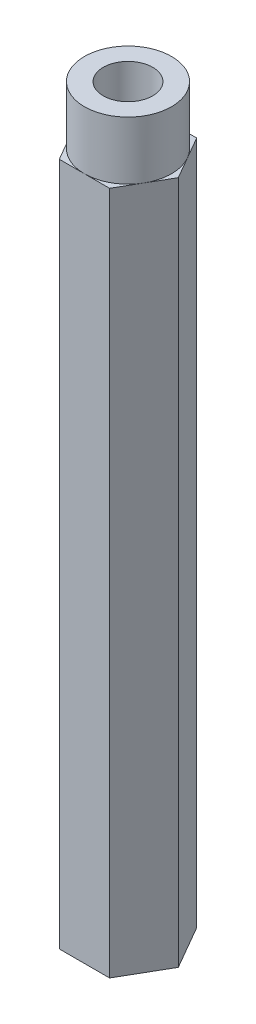
ISO-10303-21;
HEADER;
FILE_DESCRIPTION(('STEP AP214'),'2;1');
FILE_NAME('part.step','',(''),(''),'','','');
FILE_SCHEMA(('AUTOMOTIVE_DESIGN { 1 0 10303 214 1 1 1 1 }'));
ENDSEC;
DATA;
#1=APPLICATION_CONTEXT('core data for automotive mechanical design processes');
#2=APPLICATION_PROTOCOL_DEFINITION('international standard','automotive_design',2000,#1);
#3=PRODUCT_CONTEXT('',#1,'mechanical');
#4=PRODUCT('Part','Part','',(#3));
#5=PRODUCT_RELATED_PRODUCT_CATEGORY('part','',(#4));
#6=PRODUCT_DEFINITION_FORMATION('','',#4);
#7=PRODUCT_DEFINITION_CONTEXT('part definition',#1,'design');
#8=PRODUCT_DEFINITION('design','',#6,#7);
#9=PRODUCT_DEFINITION_SHAPE('','',#8);
#10=(LENGTH_UNIT() NAMED_UNIT(*) SI_UNIT(.MILLI.,.METRE.));
#11=(NAMED_UNIT(*) PLANE_ANGLE_UNIT() SI_UNIT($,.RADIAN.));
#12=(NAMED_UNIT(*) SI_UNIT($,.STERADIAN.) SOLID_ANGLE_UNIT());
#13=UNCERTAINTY_MEASURE_WITH_UNIT(LENGTH_MEASURE(1.E-05),#10,'distance_accuracy_value','');
#14=(GEOMETRIC_REPRESENTATION_CONTEXT(3) GLOBAL_UNCERTAINTY_ASSIGNED_CONTEXT((#13)) GLOBAL_UNIT_ASSIGNED_CONTEXT((#10,
#11,#12)) REPRESENTATION_CONTEXT('',''));
#15=CARTESIAN_POINT('',(0.,0.,0.));
#16=DIRECTION('',(0.,0.,1.));
#17=DIRECTION('',(1.,0.,0.));
#18=AXIS2_PLACEMENT_3D('',#15,#16,#17);
#19=CARTESIAN_POINT('',(0.,18.6944,0.));
#20=DIRECTION('',(0.,1.,0.));
#21=DIRECTION('',(0.,0.,1.));
#22=AXIS2_PLACEMENT_3D('',#19,#20,#21);
#23=PLANE('',#22);
#24=CARTESIAN_POINT('',(0.,18.6944,0.));
#25=DIRECTION('',(0.,1.,0.));
#26=DIRECTION('',(0.,0.,1.));
#27=AXIS2_PLACEMENT_3D('',#24,#25,#26);
#28=CIRCLE('',#27,2.38125);
#29=CARTESIAN_POINT('',(0.,18.6944,2.38125));
#30=VERTEX_POINT('',#29);
#31=CARTESIAN_POINT('',(2.06222299276169,18.6944,1.190625));
#32=VERTEX_POINT('',#31);
#33=EDGE_CURVE('E51',#30,#32,#28,.T.);
#34=ORIENTED_EDGE('',*,*,#33,.F.);
#35=DIRECTION('',(1.,0.,0.));
#36=VECTOR('',#35,1.);
#37=CARTESIAN_POINT('',(-1.3748153285078,18.6944,2.38125));
#38=LINE('',#37,#36);
#39=CARTESIAN_POINT('',(1.3748153285078,18.6944,2.38125));
#40=VERTEX_POINT('',#39);
#41=EDGE_CURVE('E122',#30,#40,#38,.T.);
#42=ORIENTED_EDGE('',*,*,#41,.T.);
#43=DIRECTION('',(0.5,0.,-0.866025403784439));
#44=VECTOR('',#43,1.);
#45=CARTESIAN_POINT('',(1.3748153285078,18.6944,2.38125));
#46=LINE('',#45,#44);
#47=EDGE_CURVE('E134',#40,#32,#46,.T.);
#48=ORIENTED_EDGE('',*,*,#47,.T.);
#49=EDGE_LOOP('',(#34,#42,#48));
#50=FACE_BOUND('',#49,.T.);
#51=ADVANCED_FACE('F39',(#50),#23,.T.);
#52=CARTESIAN_POINT('',(2.06222299276169,18.6944,-1.190625));
#53=VERTEX_POINT('',#52);
#54=EDGE_CURVE('E11',#32,#53,#28,.T.);
#55=ORIENTED_EDGE('',*,*,#54,.F.);
#56=CARTESIAN_POINT('',(2.74963065701559,18.6944,0.));
#57=VERTEX_POINT('',#56);
#58=EDGE_CURVE('E121',#32,#57,#46,.T.);
#59=ORIENTED_EDGE('',*,*,#58,.T.);
#60=DIRECTION('',(-0.5,0.,-0.866025403784439));
#61=VECTOR('',#60,1.);
#62=CARTESIAN_POINT('',(2.74963065701559,18.6944,0.));
#63=LINE('',#62,#61);
#64=EDGE_CURVE('E152',#57,#53,#63,.T.);
#65=ORIENTED_EDGE('',*,*,#64,.T.);
#66=EDGE_LOOP('',(#55,#59,#65));
#67=FACE_BOUND('',#66,.T.);
#68=ADVANCED_FACE('F235',(#67),#23,.T.);
#69=CARTESIAN_POINT('',(0.,18.6944,-2.38125));
#70=VERTEX_POINT('',#69);
#71=EDGE_CURVE('E49',#53,#70,#28,.T.);
#72=ORIENTED_EDGE('',*,*,#71,.F.);
#73=CARTESIAN_POINT('',(1.37481532850779,18.6944,-2.38125));
#74=VERTEX_POINT('',#73);
#75=EDGE_CURVE('E151',#53,#74,#63,.T.);
#76=ORIENTED_EDGE('',*,*,#75,.T.);
#77=DIRECTION('',(-1.,0.,0.));
#78=VECTOR('',#77,1.);
#79=CARTESIAN_POINT('',(1.37481532850779,18.6944,-2.38125));
#80=LINE('',#79,#78);
#81=EDGE_CURVE('E157',#74,#70,#80,.T.);
#82=ORIENTED_EDGE('',*,*,#81,.T.);
#83=EDGE_LOOP('',(#72,#76,#82));
#84=FACE_BOUND('',#83,.T.);
#85=ADVANCED_FACE('F232',(#84),#23,.T.);
#86=CARTESIAN_POINT('',(-2.06222299276169,18.6944,-1.190625));
#87=VERTEX_POINT('',#86);
#88=EDGE_CURVE('E144',#70,#87,#28,.T.);
#89=ORIENTED_EDGE('',*,*,#88,.F.);
#90=CARTESIAN_POINT('',(-1.3748153285078,18.6944,-2.38125));
#91=VERTEX_POINT('',#90);
#92=EDGE_CURVE('E156',#70,#91,#80,.T.);
#93=ORIENTED_EDGE('',*,*,#92,.T.);
#94=DIRECTION('',(-0.5,0.,0.866025403784439));
#95=VECTOR('',#94,1.);
#96=CARTESIAN_POINT('',(-1.3748153285078,18.6944,-2.38125));
#97=LINE('',#96,#95);
#98=EDGE_CURVE('E162',#91,#87,#97,.T.);
#99=ORIENTED_EDGE('',*,*,#98,.T.);
#100=EDGE_LOOP('',(#89,#93,#99));
#101=FACE_BOUND('',#100,.T.);
#102=ADVANCED_FACE('F227',(#101),#23,.T.);
#103=CARTESIAN_POINT('',(-2.06222299276169,18.6944,1.190625));
#104=VERTEX_POINT('',#103);
#105=EDGE_CURVE('E66',#87,#104,#28,.T.);
#106=ORIENTED_EDGE('',*,*,#105,.F.);
#107=CARTESIAN_POINT('',(-2.74963065701559,18.6944,0.));
#108=VERTEX_POINT('',#107);
#109=EDGE_CURVE('E161',#87,#108,#97,.T.);
#110=ORIENTED_EDGE('',*,*,#109,.T.);
#111=DIRECTION('',(0.5,0.,0.866025403784439));
#112=VECTOR('',#111,1.);
#113=CARTESIAN_POINT('',(-2.74963065701559,18.6944,0.));
#114=LINE('',#113,#112);
#115=EDGE_CURVE('E166',#108,#104,#114,.T.);
#116=ORIENTED_EDGE('',*,*,#115,.T.);
#117=EDGE_LOOP('',(#106,#110,#116));
#118=FACE_BOUND('',#117,.T.);
#119=ADVANCED_FACE('F268',(#118),#23,.T.);
#120=CARTESIAN_POINT('',(-1.3748153285078,18.6944,2.38125));
#121=DIRECTION('',(0.,0.,-1.));
#122=DIRECTION('',(-1.,0.,0.));
#123=AXIS2_PLACEMENT_3D('',#120,#121,#122);
#124=PLANE('',#123);
#125=DIRECTION('',(1.,0.,0.));
#126=VECTOR('',#125,1.);
#127=CARTESIAN_POINT('',(-1.3748153285078,-18.6944,2.38125));
#128=LINE('',#127,#126);
#129=CARTESIAN_POINT('',(-1.3748153285078,-18.6944,2.38125));
#130=VERTEX_POINT('',#129);
#131=CARTESIAN_POINT('',(1.3748153285078,-18.6944,2.38125));
#132=VERTEX_POINT('',#131);
#133=EDGE_CURVE('E170',#130,#132,#128,.T.);
#134=ORIENTED_EDGE('',*,*,#133,.T.);
#135=DIRECTION('',(0.,-1.,0.));
#136=VECTOR('',#135,1.);
#137=CARTESIAN_POINT('',(1.3748153285078,18.6944,2.38125));
#138=LINE('',#137,#136);
#139=EDGE_CURVE('E43',#40,#132,#138,.T.);
#140=ORIENTED_EDGE('',*,*,#139,.F.);
#141=ORIENTED_EDGE('',*,*,#41,.F.);
#142=CARTESIAN_POINT('',(-1.3748153285078,18.6944,2.38125));
#143=VERTEX_POINT('',#142);
#144=EDGE_CURVE('E113',#143,#30,#38,.T.);
#145=ORIENTED_EDGE('',*,*,#144,.F.);
#146=DIRECTION('',(0.,-1.,0.));
#147=VECTOR('',#146,1.);
#148=CARTESIAN_POINT('',(-1.3748153285078,18.6944,2.38125));
#149=LINE('',#148,#147);
#150=EDGE_CURVE('E169',#143,#130,#149,.T.);
#151=ORIENTED_EDGE('',*,*,#150,.T.);
#152=EDGE_LOOP('',(#134,#140,#141,#145,#151));
#153=FACE_BOUND('',#152,.T.);
#154=ADVANCED_FACE('F41',(#153),#124,.F.);
#155=CARTESIAN_POINT('',(1.3748153285078,18.6944,2.38125));
#156=DIRECTION('',(-0.866025403784439,0.,-0.5));
#157=DIRECTION('',(-0.5,0.,0.866025403784439));
#158=AXIS2_PLACEMENT_3D('',#155,#156,#157);
#159=PLANE('',#158);
#160=DIRECTION('',(0.5,0.,-0.866025403784439));
#161=VECTOR('',#160,1.);
#162=CARTESIAN_POINT('',(1.3748153285078,-18.6944,2.38125));
#163=LINE('',#162,#161);
#164=CARTESIAN_POINT('',(2.74963065701559,-18.6944,0.));
#165=VERTEX_POINT('',#164);
#166=EDGE_CURVE('E173',#132,#165,#163,.T.);
#167=ORIENTED_EDGE('',*,*,#166,.T.);
#168=DIRECTION('',(0.,-1.,0.));
#169=VECTOR('',#168,1.);
#170=CARTESIAN_POINT('',(2.74963065701559,18.6944,0.));
#171=LINE('',#170,#169);
#172=EDGE_CURVE('E145',#57,#165,#171,.T.);
#173=ORIENTED_EDGE('',*,*,#172,.F.);
#174=ORIENTED_EDGE('',*,*,#58,.F.);
#175=ORIENTED_EDGE('',*,*,#47,.F.);
#176=ORIENTED_EDGE('',*,*,#139,.T.);
#177=EDGE_LOOP('',(#167,#173,#174,#175,#176));
#178=FACE_BOUND('',#177,.T.);
#179=ADVANCED_FACE('F279',(#178),#159,.F.);
#180=CARTESIAN_POINT('',(2.74963065701559,18.6944,0.));
#181=DIRECTION('',(-0.866025403784439,0.,0.5));
#182=DIRECTION('',(0.5,0.,0.866025403784439));
#183=AXIS2_PLACEMENT_3D('',#180,#181,#182);
#184=PLANE('',#183);
#185=DIRECTION('',(-0.5,0.,-0.866025403784439));
#186=VECTOR('',#185,1.);
#187=CARTESIAN_POINT('',(2.74963065701559,-18.6944,0.));
#188=LINE('',#187,#186);
#189=CARTESIAN_POINT('',(1.37481532850779,-18.6944,-2.38125));
#190=VERTEX_POINT('',#189);
#191=EDGE_CURVE('E176',#165,#190,#188,.T.);
#192=ORIENTED_EDGE('',*,*,#191,.T.);
#193=DIRECTION('',(0.,-1.,0.));
#194=VECTOR('',#193,1.);
#195=CARTESIAN_POINT('',(1.37481532850779,18.6944,-2.38125));
#196=LINE('',#195,#194);
#197=EDGE_CURVE('E197',#74,#190,#196,.T.);
#198=ORIENTED_EDGE('',*,*,#197,.F.);
#199=ORIENTED_EDGE('',*,*,#75,.F.);
#200=ORIENTED_EDGE('',*,*,#64,.F.);
#201=ORIENTED_EDGE('',*,*,#172,.T.);
#202=EDGE_LOOP('',(#192,#198,#199,#200,#201));
#203=FACE_BOUND('',#202,.T.);
#204=ADVANCED_FACE('F206',(#203),#184,.F.);
#205=CARTESIAN_POINT('',(1.37481532850779,18.6944,-2.38125));
#206=DIRECTION('',(0.,0.,1.));
#207=DIRECTION('',(1.,0.,0.));
#208=AXIS2_PLACEMENT_3D('',#205,#206,#207);
#209=PLANE('',#208);
#210=DIRECTION('',(-1.,0.,0.));
#211=VECTOR('',#210,1.);
#212=CARTESIAN_POINT('',(1.37481532850779,-18.6944,-2.38125));
#213=LINE('',#212,#211);
#214=CARTESIAN_POINT('',(-1.3748153285078,-18.6944,-2.38125));
#215=VERTEX_POINT('',#214);
#216=EDGE_CURVE('E179',#190,#215,#213,.T.);
#217=ORIENTED_EDGE('',*,*,#216,.T.);
#218=DIRECTION('',(0.,-1.,0.));
#219=VECTOR('',#218,1.);
#220=CARTESIAN_POINT('',(-1.3748153285078,18.6944,-2.38125));
#221=LINE('',#220,#219);
#222=EDGE_CURVE('E193',#91,#215,#221,.T.);
#223=ORIENTED_EDGE('',*,*,#222,.F.);
#224=ORIENTED_EDGE('',*,*,#92,.F.);
#225=ORIENTED_EDGE('',*,*,#81,.F.);
#226=ORIENTED_EDGE('',*,*,#197,.T.);
#227=EDGE_LOOP('',(#217,#223,#224,#225,#226));
#228=FACE_BOUND('',#227,.T.);
#229=ADVANCED_FACE('F219',(#228),#209,.F.);
#230=CARTESIAN_POINT('',(-1.3748153285078,18.6944,-2.38125));
#231=DIRECTION('',(0.866025403784439,0.,0.5));
#232=DIRECTION('',(0.5,0.,-0.866025403784439));
#233=AXIS2_PLACEMENT_3D('',#230,#231,#232);
#234=PLANE('',#233);
#235=DIRECTION('',(-0.5,0.,0.866025403784439));
#236=VECTOR('',#235,1.);
#237=CARTESIAN_POINT('',(-1.3748153285078,-18.6944,-2.38125));
#238=LINE('',#237,#236);
#239=CARTESIAN_POINT('',(-2.74963065701559,-18.6944,0.));
#240=VERTEX_POINT('',#239);
#241=EDGE_CURVE('E182',#215,#240,#238,.T.);
#242=ORIENTED_EDGE('',*,*,#241,.T.);
#243=DIRECTION('',(0.,-1.,0.));
#244=VECTOR('',#243,1.);
#245=CARTESIAN_POINT('',(-2.74963065701559,18.6944,0.));
#246=LINE('',#245,#244);
#247=EDGE_CURVE('E189',#108,#240,#246,.T.);
#248=ORIENTED_EDGE('',*,*,#247,.F.);
#249=ORIENTED_EDGE('',*,*,#109,.F.);
#250=ORIENTED_EDGE('',*,*,#98,.F.);
#251=ORIENTED_EDGE('',*,*,#222,.T.);
#252=EDGE_LOOP('',(#242,#248,#249,#250,#251));
#253=FACE_BOUND('',#252,.T.);
#254=ADVANCED_FACE('F224',(#253),#234,.F.);
#255=CARTESIAN_POINT('',(-2.74963065701559,18.6944,0.));
#256=DIRECTION('',(0.866025403784439,0.,-0.5));
#257=DIRECTION('',(-0.5,0.,-0.866025403784439));
#258=AXIS2_PLACEMENT_3D('',#255,#256,#257);
#259=PLANE('',#258);
#260=DIRECTION('',(0.5,0.,0.866025403784439));
#261=VECTOR('',#260,1.);
#262=CARTESIAN_POINT('',(-2.74963065701559,-18.6944,0.));
#263=LINE('',#262,#261);
#264=EDGE_CURVE('E132',#240,#130,#263,.T.);
#265=ORIENTED_EDGE('',*,*,#264,.T.);
#266=ORIENTED_EDGE('',*,*,#150,.F.);
#267=EDGE_CURVE('E116',#104,#143,#114,.T.);
#268=ORIENTED_EDGE('',*,*,#267,.F.);
#269=ORIENTED_EDGE('',*,*,#115,.F.);
#270=ORIENTED_EDGE('',*,*,#247,.T.);
#271=EDGE_LOOP('',(#265,#266,#268,#269,#270));
#272=FACE_BOUND('',#271,.T.);
#273=ADVANCED_FACE('F267',(#272),#259,.F.);
#274=EDGE_CURVE('E58',#104,#30,#28,.T.);
#275=ORIENTED_EDGE('',*,*,#274,.F.);
#276=ORIENTED_EDGE('',*,*,#267,.T.);
#277=ORIENTED_EDGE('',*,*,#144,.T.);
#278=EDGE_LOOP('',(#275,#276,#277));
#279=FACE_BOUND('',#278,.T.);
#280=ADVANCED_FACE('F115',(#279),#23,.T.);
#281=CARTESIAN_POINT('',(0.,-18.6944,0.));
#282=DIRECTION('',(0.,1.,0.));
#283=DIRECTION('',(0.,0.,1.));
#284=AXIS2_PLACEMENT_3D('',#281,#282,#283);
#285=PLANE('',#284);
#286=ORIENTED_EDGE('',*,*,#133,.F.);
#287=ORIENTED_EDGE('',*,*,#264,.F.);
#288=ORIENTED_EDGE('',*,*,#241,.F.);
#289=ORIENTED_EDGE('',*,*,#216,.F.);
#290=ORIENTED_EDGE('',*,*,#191,.F.);
#291=ORIENTED_EDGE('',*,*,#166,.F.);
#292=EDGE_LOOP('',(#286,#287,#288,#289,#290,#291));
#293=FACE_BOUND('',#292,.T.);
#294=ADVANCED_FACE('F214',(#293),#285,.F.);
#295=CARTESIAN_POINT('',(0.,21.8694,0.));
#296=DIRECTION('',(0.,-1.,0.));
#297=DIRECTION('',(0.,0.,-1.));
#298=AXIS2_PLACEMENT_3D('',#295,#296,#297);
#299=CYLINDRICAL_SURFACE('',#298,2.38125);
#300=CARTESIAN_POINT('',(0.,21.8694,0.));
#301=DIRECTION('',(0.,1.,0.));
#302=DIRECTION('',(0.,0.,1.));
#303=AXIS2_PLACEMENT_3D('',#300,#301,#302);
#304=CIRCLE('',#303,2.38125);
#305=CARTESIAN_POINT('',(0.,21.8694,2.38125));
#306=VERTEX_POINT('',#305);
#307=EDGE_CURVE('E137',#306,#306,#304,.T.);
#308=ORIENTED_EDGE('',*,*,#307,.F.);
#309=EDGE_LOOP('',(#308));
#310=FACE_BOUND('',#309,.T.);
#311=ORIENTED_EDGE('',*,*,#33,.T.);
#312=ORIENTED_EDGE('',*,*,#54,.T.);
#313=ORIENTED_EDGE('',*,*,#71,.T.);
#314=ORIENTED_EDGE('',*,*,#88,.T.);
#315=ORIENTED_EDGE('',*,*,#105,.T.);
#316=ORIENTED_EDGE('',*,*,#274,.T.);
#317=EDGE_LOOP('',(#311,#312,#313,#314,#315,#316));
#318=FACE_BOUND('',#317,.T.);
#319=ADVANCED_FACE('F139',(#310,#318),#299,.T.);
#320=CARTESIAN_POINT('',(0.,21.8694,0.));
#321=DIRECTION('',(0.,1.,0.));
#322=DIRECTION('',(0.,0.,1.));
#323=AXIS2_PLACEMENT_3D('',#320,#321,#322);
#324=PLANE('',#323);
#325=CARTESIAN_POINT('',(0.,21.8694,0.));
#326=DIRECTION('',(0.,1.,0.));
#327=DIRECTION('',(0.,0.,1.));
#328=AXIS2_PLACEMENT_3D('',#325,#326,#327);
#329=CIRCLE('',#328,1.35255);
#330=CARTESIAN_POINT('',(0.,21.8694,1.35255));
#331=VERTEX_POINT('',#330);
#332=EDGE_CURVE('E242',#331,#331,#329,.T.);
#333=ORIENTED_EDGE('',*,*,#332,.F.);
#334=EDGE_LOOP('',(#333));
#335=FACE_BOUND('',#334,.T.);
#336=ORIENTED_EDGE('',*,*,#307,.T.);
#337=EDGE_LOOP('',(#336));
#338=FACE_BOUND('',#337,.T.);
#339=ADVANCED_FACE('F249',(#335,#338),#324,.T.);
#340=CARTESIAN_POINT('',(0.,15.5194,0.));
#341=DIRECTION('',(0.,1.,0.));
#342=DIRECTION('',(0.,0.,1.));
#343=AXIS2_PLACEMENT_3D('',#340,#341,#342);
#344=CYLINDRICAL_SURFACE('',#343,1.35255);
#345=CARTESIAN_POINT('',(0.,15.5194,0.));
#346=DIRECTION('',(0.,1.,0.));
#347=DIRECTION('',(0.,0.,1.));
#348=AXIS2_PLACEMENT_3D('',#345,#346,#347);
#349=CIRCLE('',#348,1.35255);
#350=CARTESIAN_POINT('',(0.,15.5194,1.35255));
#351=VERTEX_POINT('',#350);
#352=EDGE_CURVE('E138',#351,#351,#349,.T.);
#353=ORIENTED_EDGE('',*,*,#352,.F.);
#354=EDGE_LOOP('',(#353));
#355=FACE_BOUND('',#354,.T.);
#356=ORIENTED_EDGE('',*,*,#332,.T.);
#357=EDGE_LOOP('',(#356));
#358=FACE_BOUND('',#357,.T.);
#359=ADVANCED_FACE('F247',(#355,#358),#344,.F.);
#360=CARTESIAN_POINT('',(0.,15.5194,0.));
#361=DIRECTION('',(0.,1.,0.));
#362=DIRECTION('',(0.,0.,1.));
#363=AXIS2_PLACEMENT_3D('',#360,#361,#362);
#364=PLANE('',#363);
#365=ORIENTED_EDGE('',*,*,#352,.T.);
#366=EDGE_LOOP('',(#365));
#367=FACE_BOUND('',#366,.T.);
#368=ADVANCED_FACE('F375',(#367),#364,.T.);
#369=CLOSED_SHELL('',(#51,#68,#85,#102,#119,#154,#179,#204,#229,#254,#273,#280,#294,#319,#339,
#359,#368));
#370=MANIFOLD_SOLID_BREP('B2',#369);
#371=ADVANCED_BREP_SHAPE_REPRESENTATION('',(#18,#370),#14);
#372=SHAPE_DEFINITION_REPRESENTATION(#9,#371);
ENDSEC;
END-ISO-10303-21;
